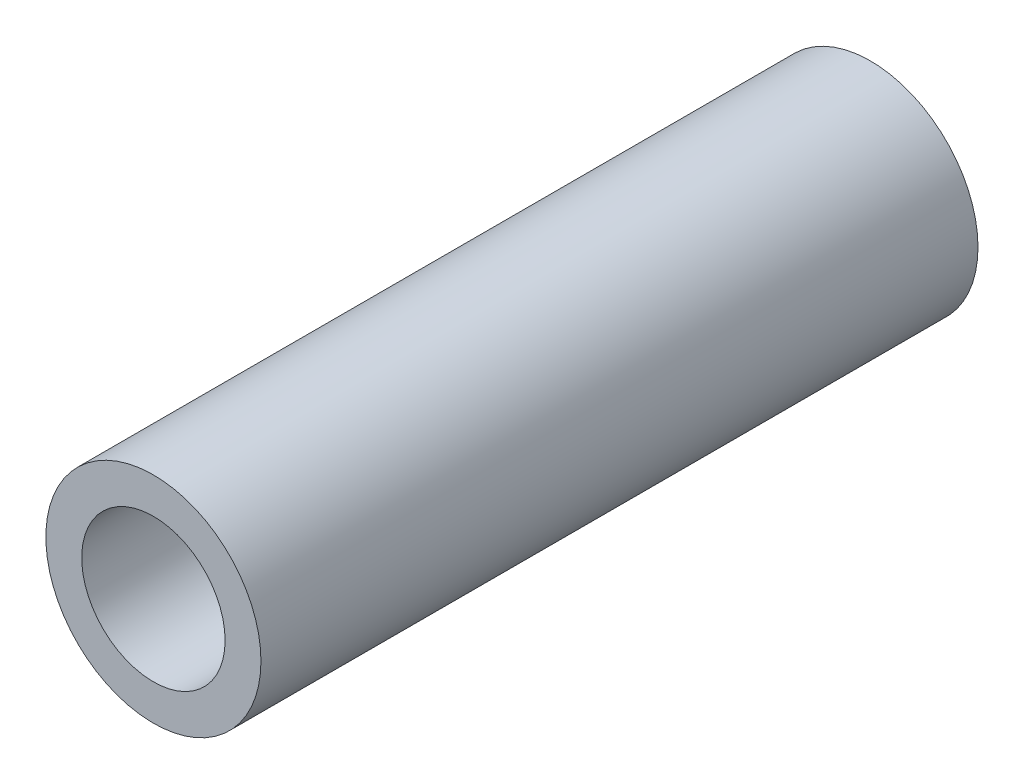
ISO-10303-21;
HEADER;
FILE_DESCRIPTION(('STEP AP214'),'2;1');
FILE_NAME('part.step','',(''),(''),'','','');
FILE_SCHEMA(('AUTOMOTIVE_DESIGN { 1 0 10303 214 1 1 1 1 }'));
ENDSEC;
DATA;
#1=APPLICATION_CONTEXT('core data for automotive mechanical design processes');
#2=APPLICATION_PROTOCOL_DEFINITION('international standard','automotive_design',2000,#1);
#3=PRODUCT_CONTEXT('',#1,'mechanical');
#4=PRODUCT('Part','Part','',(#3));
#5=PRODUCT_RELATED_PRODUCT_CATEGORY('part','',(#4));
#6=PRODUCT_DEFINITION_FORMATION('','',#4);
#7=PRODUCT_DEFINITION_CONTEXT('part definition',#1,'design');
#8=PRODUCT_DEFINITION('design','',#6,#7);
#9=PRODUCT_DEFINITION_SHAPE('','',#8);
#10=(LENGTH_UNIT() NAMED_UNIT(*) SI_UNIT(.MILLI.,.METRE.));
#11=(NAMED_UNIT(*) PLANE_ANGLE_UNIT() SI_UNIT($,.RADIAN.));
#12=(NAMED_UNIT(*) SI_UNIT($,.STERADIAN.) SOLID_ANGLE_UNIT());
#13=UNCERTAINTY_MEASURE_WITH_UNIT(LENGTH_MEASURE(1.E-05),#10,'distance_accuracy_value','');
#14=(GEOMETRIC_REPRESENTATION_CONTEXT(3) GLOBAL_UNCERTAINTY_ASSIGNED_CONTEXT((#13)) GLOBAL_UNIT_ASSIGNED_CONTEXT((#10,
#11,#12)) REPRESENTATION_CONTEXT('',''));
#15=CARTESIAN_POINT('',(0.,0.,0.));
#16=DIRECTION('',(0.,0.,1.));
#17=DIRECTION('',(1.,0.,0.));
#18=AXIS2_PLACEMENT_3D('',#15,#16,#17);
#19=CARTESIAN_POINT('',(0.,0.,20.));
#20=DIRECTION('',(0.,0.,1.));
#21=DIRECTION('',(1.,0.,0.));
#22=AXIS2_PLACEMENT_3D('',#19,#20,#21);
#23=PLANE('',#22);
#24=CARTESIAN_POINT('',(0.,0.,20.));
#25=DIRECTION('',(0.,0.,1.));
#26=DIRECTION('',(1.,0.,0.));
#27=AXIS2_PLACEMENT_3D('',#24,#25,#26);
#28=CIRCLE('',#27,3.);
#29=CARTESIAN_POINT('',(3.,0.,20.));
#30=VERTEX_POINT('',#29);
#31=EDGE_CURVE('E10',#30,#30,#28,.T.);
#32=ORIENTED_EDGE('',*,*,#31,.T.);
#33=EDGE_LOOP('',(#32));
#34=FACE_BOUND('',#33,.T.);
#35=CARTESIAN_POINT('',(0.,0.,20.));
#36=DIRECTION('',(0.,0.,1.));
#37=DIRECTION('',(1.,0.,0.));
#38=AXIS2_PLACEMENT_3D('',#35,#36,#37);
#39=CIRCLE('',#38,2.);
#40=CARTESIAN_POINT('',(2.,0.,20.));
#41=VERTEX_POINT('',#40);
#42=EDGE_CURVE('E47',#41,#41,#39,.T.);
#43=ORIENTED_EDGE('',*,*,#42,.F.);
#44=EDGE_LOOP('',(#43));
#45=FACE_BOUND('',#44,.T.);
#46=ADVANCED_FACE('F36',(#34,#45),#23,.T.);
#47=CARTESIAN_POINT('',(0.,0.,0.));
#48=DIRECTION('',(0.,0.,1.));
#49=DIRECTION('',(1.,0.,0.));
#50=AXIS2_PLACEMENT_3D('',#47,#48,#49);
#51=PLANE('',#50);
#52=CARTESIAN_POINT('',(0.,0.,0.));
#53=DIRECTION('',(0.,0.,1.));
#54=DIRECTION('',(1.,0.,0.));
#55=AXIS2_PLACEMENT_3D('',#52,#53,#54);
#56=CIRCLE('',#55,3.);
#57=CARTESIAN_POINT('',(3.,0.,0.));
#58=VERTEX_POINT('',#57);
#59=EDGE_CURVE('E40',#58,#58,#56,.T.);
#60=ORIENTED_EDGE('',*,*,#59,.F.);
#61=EDGE_LOOP('',(#60));
#62=FACE_BOUND('',#61,.T.);
#63=CARTESIAN_POINT('',(0.,0.,0.));
#64=DIRECTION('',(0.,0.,1.));
#65=DIRECTION('',(1.,0.,0.));
#66=AXIS2_PLACEMENT_3D('',#63,#64,#65);
#67=CIRCLE('',#66,2.);
#68=CARTESIAN_POINT('',(2.,0.,0.));
#69=VERTEX_POINT('',#68);
#70=EDGE_CURVE('E49',#69,#69,#67,.T.);
#71=ORIENTED_EDGE('',*,*,#70,.T.);
#72=EDGE_LOOP('',(#71));
#73=FACE_BOUND('',#72,.T.);
#74=ADVANCED_FACE('F59',(#62,#73),#51,.F.);
#75=CARTESIAN_POINT('',(0.,0.,20.));
#76=DIRECTION('',(0.,0.,-1.));
#77=DIRECTION('',(-1.,0.,0.));
#78=AXIS2_PLACEMENT_3D('',#75,#76,#77);
#79=CYLINDRICAL_SURFACE('',#78,3.);
#80=ORIENTED_EDGE('',*,*,#31,.F.);
#81=EDGE_LOOP('',(#80));
#82=FACE_BOUND('',#81,.T.);
#83=ORIENTED_EDGE('',*,*,#59,.T.);
#84=EDGE_LOOP('',(#83));
#85=FACE_BOUND('',#84,.T.);
#86=ADVANCED_FACE('F38',(#82,#85),#79,.T.);
#87=CARTESIAN_POINT('',(0.,0.,20.));
#88=DIRECTION('',(0.,0.,-1.));
#89=DIRECTION('',(-1.,0.,0.));
#90=AXIS2_PLACEMENT_3D('',#87,#88,#89);
#91=CYLINDRICAL_SURFACE('',#90,2.);
#92=ORIENTED_EDGE('',*,*,#42,.T.);
#93=EDGE_LOOP('',(#92));
#94=FACE_BOUND('',#93,.T.);
#95=ORIENTED_EDGE('',*,*,#70,.F.);
#96=EDGE_LOOP('',(#95));
#97=FACE_BOUND('',#96,.T.);
#98=ADVANCED_FACE('F55',(#94,#97),#91,.F.);
#99=CLOSED_SHELL('',(#46,#74,#86,#98));
#100=MANIFOLD_SOLID_BREP('B2',#99);
#101=ADVANCED_BREP_SHAPE_REPRESENTATION('',(#18,#100),#14);
#102=SHAPE_DEFINITION_REPRESENTATION(#9,#101);
ENDSEC;
END-ISO-10303-21;
